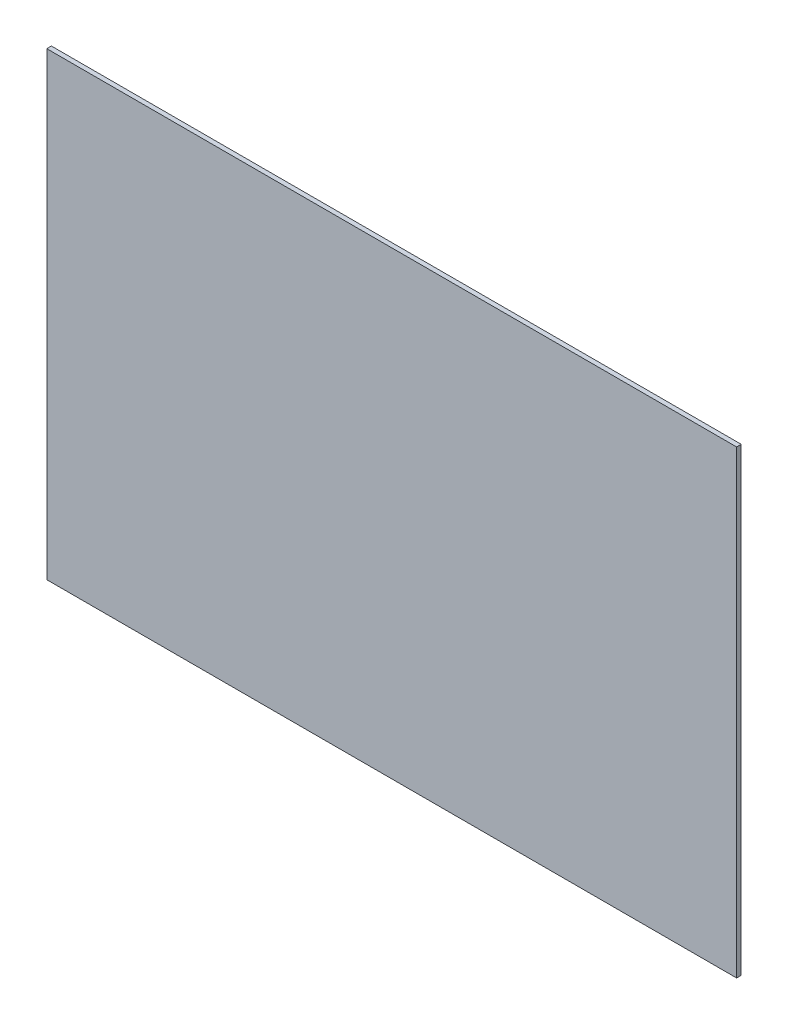
ISO-10303-21;
HEADER;
FILE_DESCRIPTION(('STEP AP214'),'2;1');
FILE_NAME('part.step','',(''),(''),'','','');
FILE_SCHEMA(('AUTOMOTIVE_DESIGN { 1 0 10303 214 1 1 1 1 }'));
ENDSEC;
DATA;
#1=APPLICATION_CONTEXT('core data for automotive mechanical design processes');
#2=APPLICATION_PROTOCOL_DEFINITION('international standard','automotive_design',2000,#1);
#3=PRODUCT_CONTEXT('',#1,'mechanical');
#4=PRODUCT('Part','Part','',(#3));
#5=PRODUCT_RELATED_PRODUCT_CATEGORY('part','',(#4));
#6=PRODUCT_DEFINITION_FORMATION('','',#4);
#7=PRODUCT_DEFINITION_CONTEXT('part definition',#1,'design');
#8=PRODUCT_DEFINITION('design','',#6,#7);
#9=PRODUCT_DEFINITION_SHAPE('','',#8);
#10=(LENGTH_UNIT() NAMED_UNIT(*) SI_UNIT(.MILLI.,.METRE.));
#11=(NAMED_UNIT(*) PLANE_ANGLE_UNIT() SI_UNIT($,.RADIAN.));
#12=(NAMED_UNIT(*) SI_UNIT($,.STERADIAN.) SOLID_ANGLE_UNIT());
#13=UNCERTAINTY_MEASURE_WITH_UNIT(LENGTH_MEASURE(1.E-05),#10,'distance_accuracy_value','');
#14=(GEOMETRIC_REPRESENTATION_CONTEXT(3) GLOBAL_UNCERTAINTY_ASSIGNED_CONTEXT((#13)) GLOBAL_UNIT_ASSIGNED_CONTEXT((#10,
#11,#12)) REPRESENTATION_CONTEXT('',''));
#15=CARTESIAN_POINT('',(0.,0.,0.));
#16=DIRECTION('',(0.,0.,1.));
#17=DIRECTION('',(1.,0.,0.));
#18=AXIS2_PLACEMENT_3D('',#15,#16,#17);
#19=CARTESIAN_POINT('',(750.,-500.,10.));
#20=DIRECTION('',(-1.,0.,0.));
#21=DIRECTION('',(0.,0.,1.));
#22=AXIS2_PLACEMENT_3D('',#19,#20,#21);
#23=PLANE('',#22);
#24=DIRECTION('',(0.,1.,0.));
#25=VECTOR('',#24,1.);
#26=CARTESIAN_POINT('',(750.,-500.,0.));
#27=LINE('',#26,#25);
#28=CARTESIAN_POINT('',(750.,-500.,0.));
#29=VERTEX_POINT('',#28);
#30=CARTESIAN_POINT('',(750.,500.,0.));
#31=VERTEX_POINT('',#30);
#32=EDGE_CURVE('E96',#29,#31,#27,.T.);
#33=ORIENTED_EDGE('',*,*,#32,.T.);
#34=DIRECTION('',(0.,0.,-1.));
#35=VECTOR('',#34,1.);
#36=CARTESIAN_POINT('',(750.,500.,10.));
#37=LINE('',#36,#35);
#38=CARTESIAN_POINT('',(750.,500.,10.));
#39=VERTEX_POINT('',#38);
#40=EDGE_CURVE('E11',#39,#31,#37,.T.);
#41=ORIENTED_EDGE('',*,*,#40,.F.);
#42=DIRECTION('',(0.,1.,0.));
#43=VECTOR('',#42,1.);
#44=CARTESIAN_POINT('',(750.,-500.,10.));
#45=LINE('',#44,#43);
#46=CARTESIAN_POINT('',(750.,-500.,10.));
#47=VERTEX_POINT('',#46);
#48=EDGE_CURVE('E84',#47,#39,#45,.T.);
#49=ORIENTED_EDGE('',*,*,#48,.F.);
#50=DIRECTION('',(0.,0.,-1.));
#51=VECTOR('',#50,1.);
#52=CARTESIAN_POINT('',(750.,-500.,10.));
#53=LINE('',#52,#51);
#54=EDGE_CURVE('E92',#47,#29,#53,.T.);
#55=ORIENTED_EDGE('',*,*,#54,.T.);
#56=EDGE_LOOP('',(#33,#41,#49,#55));
#57=FACE_BOUND('',#56,.T.);
#58=ADVANCED_FACE('F33',(#57),#23,.F.);
#59=CARTESIAN_POINT('',(-750.,500.,10.));
#60=DIRECTION('',(0.,-1.,0.));
#61=DIRECTION('',(0.,0.,-1.));
#62=AXIS2_PLACEMENT_3D('',#59,#60,#61);
#63=PLANE('',#62);
#64=DIRECTION('',(-1.,0.,0.));
#65=VECTOR('',#64,1.);
#66=CARTESIAN_POINT('',(-750.,500.,0.));
#67=LINE('',#66,#65);
#68=CARTESIAN_POINT('',(-750.,500.,0.));
#69=VERTEX_POINT('',#68);
#70=EDGE_CURVE('E88',#31,#69,#67,.T.);
#71=ORIENTED_EDGE('',*,*,#70,.T.);
#72=DIRECTION('',(0.,0.,-1.));
#73=VECTOR('',#72,1.);
#74=CARTESIAN_POINT('',(-750.,500.,10.));
#75=LINE('',#74,#73);
#76=CARTESIAN_POINT('',(-750.,500.,10.));
#77=VERTEX_POINT('',#76);
#78=EDGE_CURVE('E41',#77,#69,#75,.T.);
#79=ORIENTED_EDGE('',*,*,#78,.F.);
#80=DIRECTION('',(-1.,0.,0.));
#81=VECTOR('',#80,1.);
#82=CARTESIAN_POINT('',(-750.,500.,10.));
#83=LINE('',#82,#81);
#84=EDGE_CURVE('E79',#39,#77,#83,.T.);
#85=ORIENTED_EDGE('',*,*,#84,.F.);
#86=ORIENTED_EDGE('',*,*,#40,.T.);
#87=EDGE_LOOP('',(#71,#79,#85,#86));
#88=FACE_BOUND('',#87,.T.);
#89=ADVANCED_FACE('F87',(#88),#63,.F.);
#90=CARTESIAN_POINT('',(-750.,-500.,10.));
#91=DIRECTION('',(1.,0.,0.));
#92=DIRECTION('',(0.,0.,-1.));
#93=AXIS2_PLACEMENT_3D('',#90,#91,#92);
#94=PLANE('',#93);
#95=DIRECTION('',(0.,-1.,0.));
#96=VECTOR('',#95,1.);
#97=CARTESIAN_POINT('',(-750.,-500.,0.));
#98=LINE('',#97,#96);
#99=CARTESIAN_POINT('',(-750.,-500.,0.));
#100=VERTEX_POINT('',#99);
#101=EDGE_CURVE('E66',#69,#100,#98,.T.);
#102=ORIENTED_EDGE('',*,*,#101,.T.);
#103=DIRECTION('',(0.,0.,-1.));
#104=VECTOR('',#103,1.);
#105=CARTESIAN_POINT('',(-750.,-500.,10.));
#106=LINE('',#105,#104);
#107=CARTESIAN_POINT('',(-750.,-500.,10.));
#108=VERTEX_POINT('',#107);
#109=EDGE_CURVE('E89',#108,#100,#106,.T.);
#110=ORIENTED_EDGE('',*,*,#109,.F.);
#111=DIRECTION('',(0.,-1.,0.));
#112=VECTOR('',#111,1.);
#113=CARTESIAN_POINT('',(-750.,-500.,10.));
#114=LINE('',#113,#112);
#115=EDGE_CURVE('E82',#77,#108,#114,.T.);
#116=ORIENTED_EDGE('',*,*,#115,.F.);
#117=ORIENTED_EDGE('',*,*,#78,.T.);
#118=EDGE_LOOP('',(#102,#110,#116,#117));
#119=FACE_BOUND('',#118,.T.);
#120=ADVANCED_FACE('F90',(#119),#94,.F.);
#121=CARTESIAN_POINT('',(-750.,-500.,10.));
#122=DIRECTION('',(0.,1.,0.));
#123=DIRECTION('',(0.,0.,1.));
#124=AXIS2_PLACEMENT_3D('',#121,#122,#123);
#125=PLANE('',#124);
#126=DIRECTION('',(1.,0.,0.));
#127=VECTOR('',#126,1.);
#128=CARTESIAN_POINT('',(-750.,-500.,0.));
#129=LINE('',#128,#127);
#130=EDGE_CURVE('E72',#100,#29,#129,.T.);
#131=ORIENTED_EDGE('',*,*,#130,.T.);
#132=ORIENTED_EDGE('',*,*,#54,.F.);
#133=DIRECTION('',(1.,0.,0.));
#134=VECTOR('',#133,1.);
#135=CARTESIAN_POINT('',(-750.,-500.,10.));
#136=LINE('',#135,#134);
#137=EDGE_CURVE('E49',#108,#47,#136,.T.);
#138=ORIENTED_EDGE('',*,*,#137,.F.);
#139=ORIENTED_EDGE('',*,*,#109,.T.);
#140=EDGE_LOOP('',(#131,#132,#138,#139));
#141=FACE_BOUND('',#140,.T.);
#142=ADVANCED_FACE('F103',(#141),#125,.F.);
#143=CARTESIAN_POINT('',(0.,0.,10.));
#144=DIRECTION('',(0.,0.,-1.));
#145=DIRECTION('',(-1.,0.,0.));
#146=AXIS2_PLACEMENT_3D('',#143,#144,#145);
#147=PLANE('',#146);
#148=ORIENTED_EDGE('',*,*,#48,.T.);
#149=ORIENTED_EDGE('',*,*,#84,.T.);
#150=ORIENTED_EDGE('',*,*,#115,.T.);
#151=ORIENTED_EDGE('',*,*,#137,.T.);
#152=EDGE_LOOP('',(#148,#149,#150,#151));
#153=FACE_BOUND('',#152,.T.);
#154=ADVANCED_FACE('F80',(#153),#147,.F.);
#155=CARTESIAN_POINT('',(0.,0.,0.));
#156=DIRECTION('',(0.,0.,-1.));
#157=DIRECTION('',(-1.,0.,0.));
#158=AXIS2_PLACEMENT_3D('',#155,#156,#157);
#159=PLANE('',#158);
#160=ORIENTED_EDGE('',*,*,#32,.F.);
#161=ORIENTED_EDGE('',*,*,#130,.F.);
#162=ORIENTED_EDGE('',*,*,#101,.F.);
#163=ORIENTED_EDGE('',*,*,#70,.F.);
#164=EDGE_LOOP('',(#160,#161,#162,#163));
#165=FACE_BOUND('',#164,.T.);
#166=ADVANCED_FACE('F106',(#165),#159,.T.);
#167=CLOSED_SHELL('',(#58,#89,#120,#142,#154,#166));
#168=MANIFOLD_SOLID_BREP('B2',#167);
#169=ADVANCED_BREP_SHAPE_REPRESENTATION('',(#18,#168),#14);
#170=SHAPE_DEFINITION_REPRESENTATION(#9,#169);
ENDSEC;
END-ISO-10303-21;
